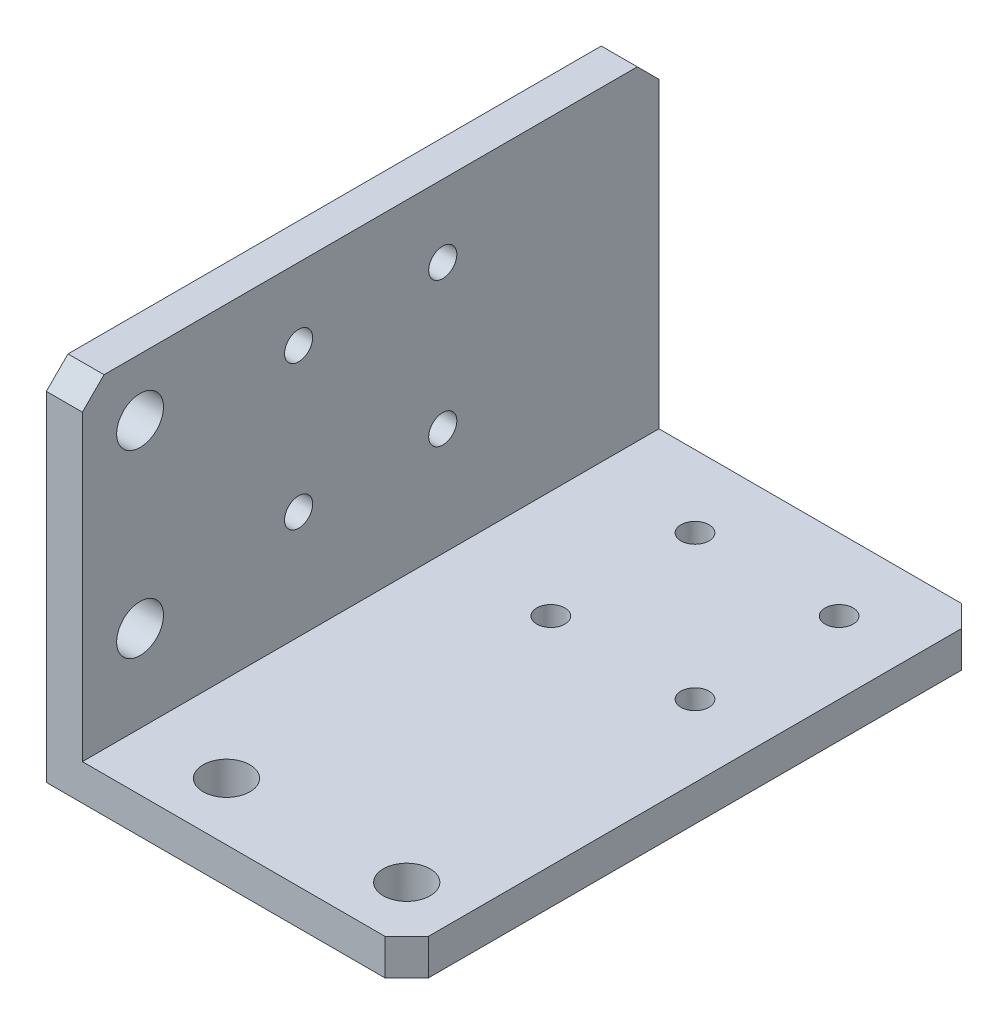
ISO-10303-21;
HEADER;
FILE_DESCRIPTION(('STEP AP214'),'2;1');
FILE_NAME('part.step','',(''),(''),'','','');
FILE_SCHEMA(('AUTOMOTIVE_DESIGN { 1 0 10303 214 1 1 1 1 }'));
ENDSEC;
DATA;
#1=APPLICATION_CONTEXT('core data for automotive mechanical design processes');
#2=APPLICATION_PROTOCOL_DEFINITION('international standard','automotive_design',2000,#1);
#3=PRODUCT_CONTEXT('',#1,'mechanical');
#4=PRODUCT('Part','Part','',(#3));
#5=PRODUCT_RELATED_PRODUCT_CATEGORY('part','',(#4));
#6=PRODUCT_DEFINITION_FORMATION('','',#4);
#7=PRODUCT_DEFINITION_CONTEXT('part definition',#1,'design');
#8=PRODUCT_DEFINITION('design','',#6,#7);
#9=PRODUCT_DEFINITION_SHAPE('','',#8);
#10=(LENGTH_UNIT() NAMED_UNIT(*) SI_UNIT(.MILLI.,.METRE.));
#11=(NAMED_UNIT(*) PLANE_ANGLE_UNIT() SI_UNIT($,.RADIAN.));
#12=(NAMED_UNIT(*) SI_UNIT($,.STERADIAN.) SOLID_ANGLE_UNIT());
#13=UNCERTAINTY_MEASURE_WITH_UNIT(LENGTH_MEASURE(1.E-05),#10,'distance_accuracy_value','');
#14=(GEOMETRIC_REPRESENTATION_CONTEXT(3) GLOBAL_UNCERTAINTY_ASSIGNED_CONTEXT((#13)) GLOBAL_UNIT_ASSIGNED_CONTEXT((#10,
#11,#12)) REPRESENTATION_CONTEXT('',''));
#15=CARTESIAN_POINT('',(0.,0.,0.));
#16=DIRECTION('',(0.,0.,1.));
#17=DIRECTION('',(1.,0.,0.));
#18=AXIS2_PLACEMENT_3D('',#15,#16,#17);
#19=CARTESIAN_POINT('',(50.,0.,80.));
#20=DIRECTION('',(0.,1.,0.));
#21=DIRECTION('',(-1.,0.,0.));
#22=AXIS2_PLACEMENT_3D('',#19,#20,#21);
#23=PLANE('',#22);
#24=CARTESIAN_POINT('',(20.,0.,30.));
#25=DIRECTION('',(0.,-1.,0.));
#26=DIRECTION('',(0.,0.,-1.));
#27=AXIS2_PLACEMENT_3D('',#24,#25,#26);
#28=CIRCLE('',#27,1.94999999999999);
#29=CARTESIAN_POINT('',(20.,0.,28.05));
#30=VERTEX_POINT('',#29);
#31=EDGE_CURVE('E410',#30,#30,#28,.T.);
#32=ORIENTED_EDGE('',*,*,#31,.F.);
#33=EDGE_LOOP('',(#32));
#34=FACE_BOUND('',#33,.T.);
#35=CARTESIAN_POINT('',(40.,0.,30.));
#36=DIRECTION('',(0.,-1.,0.));
#37=DIRECTION('',(0.,0.,-1.));
#38=AXIS2_PLACEMENT_3D('',#35,#36,#37);
#39=CIRCLE('',#38,1.94999999999999);
#40=CARTESIAN_POINT('',(40.,0.,28.0500000000001));
#41=VERTEX_POINT('',#40);
#42=EDGE_CURVE('E404',#41,#41,#39,.T.);
#43=ORIENTED_EDGE('',*,*,#42,.F.);
#44=EDGE_LOOP('',(#43));
#45=FACE_BOUND('',#44,.T.);
#46=CARTESIAN_POINT('',(40.,0.,10.));
#47=DIRECTION('',(0.,-1.,0.));
#48=DIRECTION('',(0.,0.,-1.));
#49=AXIS2_PLACEMENT_3D('',#46,#47,#48);
#50=CIRCLE('',#49,1.94999999999999);
#51=CARTESIAN_POINT('',(40.,0.,8.05000000000004));
#52=VERTEX_POINT('',#51);
#53=EDGE_CURVE('E398',#52,#52,#50,.T.);
#54=ORIENTED_EDGE('',*,*,#53,.F.);
#55=EDGE_LOOP('',(#54));
#56=FACE_BOUND('',#55,.T.);
#57=CARTESIAN_POINT('',(20.,0.,10.));
#58=DIRECTION('',(0.,-1.,0.));
#59=DIRECTION('',(0.,0.,-1.));
#60=AXIS2_PLACEMENT_3D('',#57,#58,#59);
#61=CIRCLE('',#60,1.94999999999999);
#62=CARTESIAN_POINT('',(20.,0.,8.05000000000002));
#63=VERTEX_POINT('',#62);
#64=EDGE_CURVE('E391',#63,#63,#61,.T.);
#65=ORIENTED_EDGE('',*,*,#64,.F.);
#66=EDGE_LOOP('',(#65));
#67=FACE_BOUND('',#66,.T.);
#68=CARTESIAN_POINT('',(17.,0.,72.));
#69=DIRECTION('',(0.,-1.,0.));
#70=DIRECTION('',(0.,0.,-1.));
#71=AXIS2_PLACEMENT_3D('',#68,#69,#70);
#72=CIRCLE('',#71,3.24999999999999);
#73=CARTESIAN_POINT('',(17.,0.,68.75));
#74=VERTEX_POINT('',#73);
#75=EDGE_CURVE('E172',#74,#74,#72,.T.);
#76=ORIENTED_EDGE('',*,*,#75,.F.);
#77=EDGE_LOOP('',(#76));
#78=FACE_BOUND('',#77,.T.);
#79=CARTESIAN_POINT('',(42.,0.,72.));
#80=DIRECTION('',(0.,-1.,0.));
#81=DIRECTION('',(0.,0.,-1.));
#82=AXIS2_PLACEMENT_3D('',#79,#80,#81);
#83=CIRCLE('',#82,3.24999999999999);
#84=CARTESIAN_POINT('',(42.,0.,68.75));
#85=VERTEX_POINT('',#84);
#86=EDGE_CURVE('E189',#85,#85,#83,.T.);
#87=ORIENTED_EDGE('',*,*,#86,.F.);
#88=EDGE_LOOP('',(#87));
#89=FACE_BOUND('',#88,.T.);
#90=DIRECTION('',(1.,0.,0.));
#91=VECTOR('',#90,1.);
#92=CARTESIAN_POINT('',(50.,0.,0.));
#93=LINE('',#92,#91);
#94=CARTESIAN_POINT('',(0.,0.,0.));
#95=VERTEX_POINT('',#94);
#96=CARTESIAN_POINT('',(47.,0.,0.));
#97=VERTEX_POINT('',#96);
#98=EDGE_CURVE('E154',#95,#97,#93,.T.);
#99=ORIENTED_EDGE('',*,*,#98,.T.);
#100=DIRECTION('',(0.707106781186548,0.,0.707106781186548));
#101=VECTOR('',#100,1.);
#102=CARTESIAN_POINT('',(50.,0.,3.00000000000002));
#103=LINE('',#102,#101);
#104=CARTESIAN_POINT('',(50.,0.,3.00000000000004));
#105=VERTEX_POINT('',#104);
#106=EDGE_CURVE('E217',#97,#105,#103,.T.);
#107=ORIENTED_EDGE('',*,*,#106,.T.);
#108=DIRECTION('',(0.,0.,-1.));
#109=VECTOR('',#108,1.);
#110=CARTESIAN_POINT('',(50.,0.,80.));
#111=LINE('',#110,#109);
#112=CARTESIAN_POINT('',(50.,0.,77.));
#113=VERTEX_POINT('',#112);
#114=EDGE_CURVE('E203',#113,#105,#111,.T.);
#115=ORIENTED_EDGE('',*,*,#114,.F.);
#116=DIRECTION('',(0.707106781186544,0.,-0.707106781186551));
#117=VECTOR('',#116,1.);
#118=CARTESIAN_POINT('',(47.,0.,80.));
#119=LINE('',#118,#117);
#120=CARTESIAN_POINT('',(47.,0.,80.));
#121=VERTEX_POINT('',#120);
#122=EDGE_CURVE('E57',#113,#121,#119,.F.);
#123=ORIENTED_EDGE('',*,*,#122,.T.);
#124=DIRECTION('',(1.,0.,0.));
#125=VECTOR('',#124,1.);
#126=CARTESIAN_POINT('',(50.,0.,80.));
#127=LINE('',#126,#125);
#128=CARTESIAN_POINT('',(0.,0.,80.));
#129=VERTEX_POINT('',#128);
#130=EDGE_CURVE('E129',#129,#121,#127,.T.);
#131=ORIENTED_EDGE('',*,*,#130,.F.);
#132=DIRECTION('',(0.,0.,-1.));
#133=VECTOR('',#132,1.);
#134=CARTESIAN_POINT('',(0.,0.,80.));
#135=LINE('',#134,#133);
#136=EDGE_CURVE('E150',#129,#95,#135,.T.);
#137=ORIENTED_EDGE('',*,*,#136,.T.);
#138=EDGE_LOOP('',(#99,#107,#115,#123,#131,#137));
#139=FACE_BOUND('',#138,.T.);
#140=ADVANCED_FACE('F41',(#34,#45,#56,#67,#78,#89,#139),#23,.F.);
#141=CARTESIAN_POINT('',(50.,5.,80.));
#142=DIRECTION('',(-1.,0.,0.));
#143=DIRECTION('',(0.,0.,1.));
#144=AXIS2_PLACEMENT_3D('',#141,#142,#143);
#145=PLANE('',#144);
#146=ORIENTED_EDGE('',*,*,#114,.T.);
#147=DIRECTION('',(0.,1.,0.));
#148=VECTOR('',#147,1.);
#149=CARTESIAN_POINT('',(50.,5.,3.00000000000002));
#150=LINE('',#149,#148);
#151=CARTESIAN_POINT('',(50.,5.,3.00000000000004));
#152=VERTEX_POINT('',#151);
#153=EDGE_CURVE('E340',#105,#152,#150,.T.);
#154=ORIENTED_EDGE('',*,*,#153,.T.);
#155=DIRECTION('',(0.,0.,-1.));
#156=VECTOR('',#155,1.);
#157=CARTESIAN_POINT('',(50.,5.,80.));
#158=LINE('',#157,#156);
#159=CARTESIAN_POINT('',(50.,5.,77.));
#160=VERTEX_POINT('',#159);
#161=EDGE_CURVE('E140',#160,#152,#158,.T.);
#162=ORIENTED_EDGE('',*,*,#161,.F.);
#163=DIRECTION('',(0.,-1.,0.));
#164=VECTOR('',#163,1.);
#165=CARTESIAN_POINT('',(50.,5.,77.));
#166=LINE('',#165,#164);
#167=EDGE_CURVE('E338',#160,#113,#166,.T.);
#168=ORIENTED_EDGE('',*,*,#167,.T.);
#169=EDGE_LOOP('',(#146,#154,#162,#168));
#170=FACE_BOUND('',#169,.T.);
#171=ADVANCED_FACE('F314',(#170),#145,.F.);
#172=CARTESIAN_POINT('',(5.00000000000001,5.,80.));
#173=DIRECTION('',(0.,-1.,0.));
#174=DIRECTION('',(1.,0.,0.));
#175=AXIS2_PLACEMENT_3D('',#172,#173,#174);
#176=PLANE('',#175);
#177=CARTESIAN_POINT('',(20.,5.,30.));
#178=DIRECTION('',(0.,-1.,0.));
#179=DIRECTION('',(1.,0.,0.));
#180=AXIS2_PLACEMENT_3D('',#177,#178,#179);
#181=CIRCLE('',#180,1.94999999999999);
#182=CARTESIAN_POINT('',(21.95,5.,30.));
#183=VERTEX_POINT('',#182);
#184=EDGE_CURVE('E407',#183,#183,#181,.T.);
#185=ORIENTED_EDGE('',*,*,#184,.T.);
#186=EDGE_LOOP('',(#185));
#187=FACE_BOUND('',#186,.T.);
#188=CARTESIAN_POINT('',(40.,5.,30.));
#189=DIRECTION('',(0.,-1.,0.));
#190=DIRECTION('',(1.,0.,0.));
#191=AXIS2_PLACEMENT_3D('',#188,#189,#190);
#192=CIRCLE('',#191,1.94999999999999);
#193=CARTESIAN_POINT('',(41.95,5.,30.));
#194=VERTEX_POINT('',#193);
#195=EDGE_CURVE('E401',#194,#194,#192,.T.);
#196=ORIENTED_EDGE('',*,*,#195,.T.);
#197=EDGE_LOOP('',(#196));
#198=FACE_BOUND('',#197,.T.);
#199=CARTESIAN_POINT('',(40.,5.,10.));
#200=DIRECTION('',(0.,-1.,0.));
#201=DIRECTION('',(1.,0.,0.));
#202=AXIS2_PLACEMENT_3D('',#199,#200,#201);
#203=CIRCLE('',#202,1.94999999999999);
#204=CARTESIAN_POINT('',(41.95,5.,10.));
#205=VERTEX_POINT('',#204);
#206=EDGE_CURVE('E395',#205,#205,#203,.T.);
#207=ORIENTED_EDGE('',*,*,#206,.T.);
#208=EDGE_LOOP('',(#207));
#209=FACE_BOUND('',#208,.T.);
#210=CARTESIAN_POINT('',(20.,5.,10.));
#211=DIRECTION('',(0.,-1.,0.));
#212=DIRECTION('',(1.,0.,0.));
#213=AXIS2_PLACEMENT_3D('',#210,#211,#212);
#214=CIRCLE('',#213,1.94999999999999);
#215=CARTESIAN_POINT('',(21.95,5.,10.));
#216=VERTEX_POINT('',#215);
#217=EDGE_CURVE('E45',#216,#216,#214,.T.);
#218=ORIENTED_EDGE('',*,*,#217,.T.);
#219=EDGE_LOOP('',(#218));
#220=FACE_BOUND('',#219,.T.);
#221=CARTESIAN_POINT('',(17.,5.,72.));
#222=DIRECTION('',(0.,-1.,0.));
#223=DIRECTION('',(1.,0.,0.));
#224=AXIS2_PLACEMENT_3D('',#221,#222,#223);
#225=CIRCLE('',#224,3.24999999999999);
#226=CARTESIAN_POINT('',(20.25,5.,72.));
#227=VERTEX_POINT('',#226);
#228=EDGE_CURVE('E178',#227,#227,#225,.T.);
#229=ORIENTED_EDGE('',*,*,#228,.T.);
#230=EDGE_LOOP('',(#229));
#231=FACE_BOUND('',#230,.T.);
#232=CARTESIAN_POINT('',(42.,5.,72.));
#233=DIRECTION('',(0.,-1.,0.));
#234=DIRECTION('',(1.,0.,0.));
#235=AXIS2_PLACEMENT_3D('',#232,#233,#234);
#236=CIRCLE('',#235,3.24999999999999);
#237=CARTESIAN_POINT('',(45.25,5.,72.));
#238=VERTEX_POINT('',#237);
#239=EDGE_CURVE('E193',#238,#238,#236,.T.);
#240=ORIENTED_EDGE('',*,*,#239,.T.);
#241=EDGE_LOOP('',(#240));
#242=FACE_BOUND('',#241,.T.);
#243=ORIENTED_EDGE('',*,*,#161,.T.);
#244=DIRECTION('',(-0.707106781186548,0.,-0.707106781186548));
#245=VECTOR('',#244,1.);
#246=CARTESIAN_POINT('',(50.,5.,3.00000000000002));
#247=LINE('',#246,#245);
#248=CARTESIAN_POINT('',(47.,5.,0.));
#249=VERTEX_POINT('',#248);
#250=EDGE_CURVE('E339',#152,#249,#247,.T.);
#251=ORIENTED_EDGE('',*,*,#250,.T.);
#252=DIRECTION('',(-1.,0.,0.));
#253=VECTOR('',#252,1.);
#254=CARTESIAN_POINT('',(5.00000000000001,5.,0.));
#255=LINE('',#254,#253);
#256=CARTESIAN_POINT('',(5.00000000000001,5.,0.));
#257=VERTEX_POINT('',#256);
#258=EDGE_CURVE('E136',#249,#257,#255,.T.);
#259=ORIENTED_EDGE('',*,*,#258,.T.);
#260=DIRECTION('',(0.,0.,-1.));
#261=VECTOR('',#260,1.);
#262=CARTESIAN_POINT('',(5.00000000000001,5.,80.));
#263=LINE('',#262,#261);
#264=CARTESIAN_POINT('',(5.00000000000001,5.,80.));
#265=VERTEX_POINT('',#264);
#266=EDGE_CURVE('E132',#265,#257,#263,.T.);
#267=ORIENTED_EDGE('',*,*,#266,.F.);
#268=DIRECTION('',(-1.,0.,0.));
#269=VECTOR('',#268,1.);
#270=CARTESIAN_POINT('',(5.00000000000001,5.,80.));
#271=LINE('',#270,#269);
#272=CARTESIAN_POINT('',(47.,5.,80.));
#273=VERTEX_POINT('',#272);
#274=EDGE_CURVE('E121',#273,#265,#271,.T.);
#275=ORIENTED_EDGE('',*,*,#274,.F.);
#276=DIRECTION('',(-0.707106781186544,0.,0.707106781186551));
#277=VECTOR('',#276,1.);
#278=CARTESIAN_POINT('',(47.,5.,80.));
#279=LINE('',#278,#277);
#280=EDGE_CURVE('E65',#273,#160,#279,.F.);
#281=ORIENTED_EDGE('',*,*,#280,.T.);
#282=EDGE_LOOP('',(#243,#251,#259,#267,#275,#281));
#283=FACE_BOUND('',#282,.T.);
#284=ADVANCED_FACE('F134',(#187,#198,#209,#220,#231,#242,#283),#176,.F.);
#285=CARTESIAN_POINT('',(5.,50.,80.));
#286=DIRECTION('',(-1.,0.,0.));
#287=DIRECTION('',(0.,-1.,0.));
#288=AXIS2_PLACEMENT_3D('',#285,#286,#287);
#289=PLANE('',#288);
#290=CARTESIAN_POINT('',(5.,40.,30.));
#291=DIRECTION('',(-1.,0.,0.));
#292=DIRECTION('',(0.,-1.,0.));
#293=AXIS2_PLACEMENT_3D('',#290,#291,#292);
#294=CIRCLE('',#293,1.94999999999999);
#295=CARTESIAN_POINT('',(5.,38.05,30.));
#296=VERTEX_POINT('',#295);
#297=EDGE_CURVE('E431',#296,#296,#294,.T.);
#298=ORIENTED_EDGE('',*,*,#297,.T.);
#299=EDGE_LOOP('',(#298));
#300=FACE_BOUND('',#299,.T.);
#301=CARTESIAN_POINT('',(5.,40.,50.));
#302=DIRECTION('',(-1.,0.,0.));
#303=DIRECTION('',(0.,-1.,0.));
#304=AXIS2_PLACEMENT_3D('',#301,#302,#303);
#305=CIRCLE('',#304,1.94999999999999);
#306=CARTESIAN_POINT('',(5.,38.05,50.));
#307=VERTEX_POINT('',#306);
#308=EDGE_CURVE('E425',#307,#307,#305,.T.);
#309=ORIENTED_EDGE('',*,*,#308,.T.);
#310=EDGE_LOOP('',(#309));
#311=FACE_BOUND('',#310,.T.);
#312=CARTESIAN_POINT('',(5.00000000000001,20.,50.));
#313=DIRECTION('',(-1.,0.,0.));
#314=DIRECTION('',(0.,-1.,0.));
#315=AXIS2_PLACEMENT_3D('',#312,#313,#314);
#316=CIRCLE('',#315,1.94999999999999);
#317=CARTESIAN_POINT('',(5.00000000000001,18.05,50.));
#318=VERTEX_POINT('',#317);
#319=EDGE_CURVE('E419',#318,#318,#316,.T.);
#320=ORIENTED_EDGE('',*,*,#319,.T.);
#321=EDGE_LOOP('',(#320));
#322=FACE_BOUND('',#321,.T.);
#323=CARTESIAN_POINT('',(5.00000000000001,20.,30.));
#324=DIRECTION('',(-1.,0.,0.));
#325=DIRECTION('',(0.,-1.,0.));
#326=AXIS2_PLACEMENT_3D('',#323,#324,#325);
#327=CIRCLE('',#326,1.94999999999999);
#328=CARTESIAN_POINT('',(5.00000000000001,18.05,30.));
#329=VERTEX_POINT('',#328);
#330=EDGE_CURVE('E413',#329,#329,#327,.T.);
#331=ORIENTED_EDGE('',*,*,#330,.T.);
#332=EDGE_LOOP('',(#331));
#333=FACE_BOUND('',#332,.T.);
#334=CARTESIAN_POINT('',(5.,42.,72.));
#335=DIRECTION('',(-1.,0.,0.));
#336=DIRECTION('',(0.,0.,1.));
#337=AXIS2_PLACEMENT_3D('',#334,#335,#336);
#338=CIRCLE('',#337,3.25);
#339=CARTESIAN_POINT('',(5.,42.,75.25));
#340=VERTEX_POINT('',#339);
#341=EDGE_CURVE('E380',#340,#340,#338,.T.);
#342=ORIENTED_EDGE('',*,*,#341,.T.);
#343=EDGE_LOOP('',(#342));
#344=FACE_BOUND('',#343,.T.);
#345=CARTESIAN_POINT('',(5.,17.,72.));
#346=DIRECTION('',(-1.,0.,0.));
#347=DIRECTION('',(0.,0.,1.));
#348=AXIS2_PLACEMENT_3D('',#345,#346,#347);
#349=CIRCLE('',#348,3.25);
#350=CARTESIAN_POINT('',(5.,17.,75.25));
#351=VERTEX_POINT('',#350);
#352=EDGE_CURVE('E179',#351,#351,#349,.T.);
#353=ORIENTED_EDGE('',*,*,#352,.T.);
#354=EDGE_LOOP('',(#353));
#355=FACE_BOUND('',#354,.T.);
#356=DIRECTION('',(0.,1.,0.));
#357=VECTOR('',#356,1.);
#358=CARTESIAN_POINT('',(5.,50.,0.));
#359=LINE('',#358,#357);
#360=CARTESIAN_POINT('',(5.,47.,0.));
#361=VERTEX_POINT('',#360);
#362=EDGE_CURVE('E243',#257,#361,#359,.T.);
#363=ORIENTED_EDGE('',*,*,#362,.T.);
#364=DIRECTION('',(0.,0.707106781186548,0.707106781186548));
#365=VECTOR('',#364,1.);
#366=CARTESIAN_POINT('',(5.,50.,3.00000000000002));
#367=LINE('',#366,#365);
#368=CARTESIAN_POINT('',(5.,50.,3.00000000000004));
#369=VERTEX_POINT('',#368);
#370=EDGE_CURVE('E287',#361,#369,#367,.T.);
#371=ORIENTED_EDGE('',*,*,#370,.T.);
#372=DIRECTION('',(0.,0.,-1.));
#373=VECTOR('',#372,1.);
#374=CARTESIAN_POINT('',(5.,50.,80.));
#375=LINE('',#374,#373);
#376=CARTESIAN_POINT('',(5.,50.,77.));
#377=VERTEX_POINT('',#376);
#378=EDGE_CURVE('E141',#377,#369,#375,.T.);
#379=ORIENTED_EDGE('',*,*,#378,.F.);
#380=DIRECTION('',(0.,0.707106781186544,-0.707106781186551));
#381=VECTOR('',#380,1.);
#382=CARTESIAN_POINT('',(5.,47.,80.));
#383=LINE('',#382,#381);
#384=CARTESIAN_POINT('',(5.,47.,80.));
#385=VERTEX_POINT('',#384);
#386=EDGE_CURVE('E146',#377,#385,#383,.F.);
#387=ORIENTED_EDGE('',*,*,#386,.T.);
#388=DIRECTION('',(0.,1.,0.));
#389=VECTOR('',#388,1.);
#390=CARTESIAN_POINT('',(5.,50.,80.));
#391=LINE('',#390,#389);
#392=EDGE_CURVE('E126',#265,#385,#391,.T.);
#393=ORIENTED_EDGE('',*,*,#392,.F.);
#394=ORIENTED_EDGE('',*,*,#266,.T.);
#395=EDGE_LOOP('',(#363,#371,#379,#387,#393,#394));
#396=FACE_BOUND('',#395,.T.);
#397=ADVANCED_FACE('F143',(#300,#311,#322,#333,#344,#355,#396),#289,.F.);
#398=CARTESIAN_POINT('',(0.,50.,80.));
#399=DIRECTION('',(0.,-1.,0.));
#400=DIRECTION('',(0.,0.,-1.));
#401=AXIS2_PLACEMENT_3D('',#398,#399,#400);
#402=PLANE('',#401);
#403=ORIENTED_EDGE('',*,*,#378,.T.);
#404=DIRECTION('',(-1.,0.,0.));
#405=VECTOR('',#404,1.);
#406=CARTESIAN_POINT('',(0.,50.,3.00000000000002));
#407=LINE('',#406,#405);
#408=CARTESIAN_POINT('',(0.,50.,3.00000000000004));
#409=VERTEX_POINT('',#408);
#410=EDGE_CURVE('E281',#369,#409,#407,.T.);
#411=ORIENTED_EDGE('',*,*,#410,.T.);
#412=DIRECTION('',(0.,0.,-1.));
#413=VECTOR('',#412,1.);
#414=CARTESIAN_POINT('',(0.,50.,80.));
#415=LINE('',#414,#413);
#416=CARTESIAN_POINT('',(0.,50.,77.));
#417=VERTEX_POINT('',#416);
#418=EDGE_CURVE('E238',#417,#409,#415,.T.);
#419=ORIENTED_EDGE('',*,*,#418,.F.);
#420=DIRECTION('',(1.,0.,0.));
#421=VECTOR('',#420,1.);
#422=CARTESIAN_POINT('',(0.,50.,77.));
#423=LINE('',#422,#421);
#424=EDGE_CURVE('E209',#417,#377,#423,.T.);
#425=ORIENTED_EDGE('',*,*,#424,.T.);
#426=EDGE_LOOP('',(#403,#411,#419,#425));
#427=FACE_BOUND('',#426,.T.);
#428=ADVANCED_FACE('F280',(#427),#402,.F.);
#429=CARTESIAN_POINT('',(0.,0.,80.));
#430=DIRECTION('',(1.,0.,0.));
#431=DIRECTION('',(0.,0.,-1.));
#432=AXIS2_PLACEMENT_3D('',#429,#430,#431);
#433=PLANE('',#432);
#434=CARTESIAN_POINT('',(0.,40.,30.));
#435=DIRECTION('',(-1.,0.,0.));
#436=DIRECTION('',(0.,0.,1.));
#437=AXIS2_PLACEMENT_3D('',#434,#435,#436);
#438=CIRCLE('',#437,1.94999999999999);
#439=CARTESIAN_POINT('',(0.,40.,31.95));
#440=VERTEX_POINT('',#439);
#441=EDGE_CURVE('E434',#440,#440,#438,.T.);
#442=ORIENTED_EDGE('',*,*,#441,.F.);
#443=EDGE_LOOP('',(#442));
#444=FACE_BOUND('',#443,.T.);
#445=CARTESIAN_POINT('',(0.,40.,50.));
#446=DIRECTION('',(-1.,0.,0.));
#447=DIRECTION('',(0.,0.,1.));
#448=AXIS2_PLACEMENT_3D('',#445,#446,#447);
#449=CIRCLE('',#448,1.94999999999999);
#450=CARTESIAN_POINT('',(0.,40.,51.95));
#451=VERTEX_POINT('',#450);
#452=EDGE_CURVE('E428',#451,#451,#449,.T.);
#453=ORIENTED_EDGE('',*,*,#452,.F.);
#454=EDGE_LOOP('',(#453));
#455=FACE_BOUND('',#454,.T.);
#456=CARTESIAN_POINT('',(0.,20.,50.));
#457=DIRECTION('',(-1.,0.,0.));
#458=DIRECTION('',(0.,0.,1.));
#459=AXIS2_PLACEMENT_3D('',#456,#457,#458);
#460=CIRCLE('',#459,1.94999999999999);
#461=CARTESIAN_POINT('',(0.,20.,51.95));
#462=VERTEX_POINT('',#461);
#463=EDGE_CURVE('E422',#462,#462,#460,.T.);
#464=ORIENTED_EDGE('',*,*,#463,.F.);
#465=EDGE_LOOP('',(#464));
#466=FACE_BOUND('',#465,.T.);
#467=CARTESIAN_POINT('',(0.,20.,30.));
#468=DIRECTION('',(-1.,0.,0.));
#469=DIRECTION('',(0.,0.,1.));
#470=AXIS2_PLACEMENT_3D('',#467,#468,#469);
#471=CIRCLE('',#470,1.94999999999999);
#472=CARTESIAN_POINT('',(0.,20.,31.95));
#473=VERTEX_POINT('',#472);
#474=EDGE_CURVE('E416',#473,#473,#471,.T.);
#475=ORIENTED_EDGE('',*,*,#474,.F.);
#476=EDGE_LOOP('',(#475));
#477=FACE_BOUND('',#476,.T.);
#478=CARTESIAN_POINT('',(0.,42.,72.));
#479=DIRECTION('',(-1.,0.,0.));
#480=DIRECTION('',(0.,0.,1.));
#481=AXIS2_PLACEMENT_3D('',#478,#479,#480);
#482=CIRCLE('',#481,3.24999999999999);
#483=CARTESIAN_POINT('',(0.,42.,75.25));
#484=VERTEX_POINT('',#483);
#485=EDGE_CURVE('E382',#484,#484,#482,.T.);
#486=ORIENTED_EDGE('',*,*,#485,.F.);
#487=EDGE_LOOP('',(#486));
#488=FACE_BOUND('',#487,.T.);
#489=CARTESIAN_POINT('',(0.,17.,72.));
#490=DIRECTION('',(-1.,0.,0.));
#491=DIRECTION('',(0.,0.,1.));
#492=AXIS2_PLACEMENT_3D('',#489,#490,#491);
#493=CIRCLE('',#492,3.24999999999999);
#494=CARTESIAN_POINT('',(0.,17.,75.25));
#495=VERTEX_POINT('',#494);
#496=EDGE_CURVE('E377',#495,#495,#493,.T.);
#497=ORIENTED_EDGE('',*,*,#496,.F.);
#498=EDGE_LOOP('',(#497));
#499=FACE_BOUND('',#498,.T.);
#500=ORIENTED_EDGE('',*,*,#418,.T.);
#501=DIRECTION('',(0.,-0.707106781186548,-0.707106781186548));
#502=VECTOR('',#501,1.);
#503=CARTESIAN_POINT('',(0.,50.,3.00000000000002));
#504=LINE('',#503,#502);
#505=CARTESIAN_POINT('',(0.,47.,0.));
#506=VERTEX_POINT('',#505);
#507=EDGE_CURVE('E260',#409,#506,#504,.T.);
#508=ORIENTED_EDGE('',*,*,#507,.T.);
#509=DIRECTION('',(0.,-1.,0.));
#510=VECTOR('',#509,1.);
#511=CARTESIAN_POINT('',(0.,0.,0.));
#512=LINE('',#511,#510);
#513=EDGE_CURVE('E235',#506,#95,#512,.T.);
#514=ORIENTED_EDGE('',*,*,#513,.T.);
#515=ORIENTED_EDGE('',*,*,#136,.F.);
#516=DIRECTION('',(0.,-1.,0.));
#517=VECTOR('',#516,1.);
#518=CARTESIAN_POINT('',(0.,0.,80.));
#519=LINE('',#518,#517);
#520=CARTESIAN_POINT('',(0.,47.,80.));
#521=VERTEX_POINT('',#520);
#522=EDGE_CURVE('E147',#521,#129,#519,.T.);
#523=ORIENTED_EDGE('',*,*,#522,.F.);
#524=DIRECTION('',(0.,-0.707106781186544,0.707106781186551));
#525=VECTOR('',#524,1.);
#526=CARTESIAN_POINT('',(0.,47.,80.));
#527=LINE('',#526,#525);
#528=EDGE_CURVE('E231',#521,#417,#527,.F.);
#529=ORIENTED_EDGE('',*,*,#528,.T.);
#530=EDGE_LOOP('',(#500,#508,#514,#515,#523,#529));
#531=FACE_BOUND('',#530,.T.);
#532=ADVANCED_FACE('F230',(#444,#455,#466,#477,#488,#499,#531),#433,.F.);
#533=CARTESIAN_POINT('',(0.,0.,80.));
#534=DIRECTION('',(0.,0.,-1.));
#535=DIRECTION('',(-1.,0.,0.));
#536=AXIS2_PLACEMENT_3D('',#533,#534,#535);
#537=PLANE('',#536);
#538=ORIENTED_EDGE('',*,*,#130,.T.);
#539=DIRECTION('',(0.,1.,0.));
#540=VECTOR('',#539,1.);
#541=CARTESIAN_POINT('',(47.,0.,80.));
#542=LINE('',#541,#540);
#543=EDGE_CURVE('E12',#121,#273,#542,.T.);
#544=ORIENTED_EDGE('',*,*,#543,.T.);
#545=ORIENTED_EDGE('',*,*,#274,.T.);
#546=ORIENTED_EDGE('',*,*,#392,.T.);
#547=DIRECTION('',(-1.,0.,0.));
#548=VECTOR('',#547,1.);
#549=CARTESIAN_POINT('',(0.,47.,80.));
#550=LINE('',#549,#548);
#551=EDGE_CURVE('E50',#385,#521,#550,.T.);
#552=ORIENTED_EDGE('',*,*,#551,.T.);
#553=ORIENTED_EDGE('',*,*,#522,.T.);
#554=EDGE_LOOP('',(#538,#544,#545,#546,#552,#553));
#555=FACE_BOUND('',#554,.T.);
#556=ADVANCED_FACE('F123',(#555),#537,.F.);
#557=CARTESIAN_POINT('',(0.,0.,0.));
#558=DIRECTION('',(0.,0.,-1.));
#559=DIRECTION('',(-1.,0.,0.));
#560=AXIS2_PLACEMENT_3D('',#557,#558,#559);
#561=PLANE('',#560);
#562=ORIENTED_EDGE('',*,*,#513,.F.);
#563=DIRECTION('',(1.,0.,0.));
#564=VECTOR('',#563,1.);
#565=CARTESIAN_POINT('',(5.,47.,0.));
#566=LINE('',#565,#564);
#567=EDGE_CURVE('E289',#506,#361,#566,.T.);
#568=ORIENTED_EDGE('',*,*,#567,.T.);
#569=ORIENTED_EDGE('',*,*,#362,.F.);
#570=ORIENTED_EDGE('',*,*,#258,.F.);
#571=DIRECTION('',(0.,-1.,0.));
#572=VECTOR('',#571,1.);
#573=CARTESIAN_POINT('',(47.,0.,0.));
#574=LINE('',#573,#572);
#575=EDGE_CURVE('E264',#249,#97,#574,.T.);
#576=ORIENTED_EDGE('',*,*,#575,.T.);
#577=ORIENTED_EDGE('',*,*,#98,.F.);
#578=EDGE_LOOP('',(#562,#568,#569,#570,#576,#577));
#579=FACE_BOUND('',#578,.T.);
#580=ADVANCED_FACE('F291',(#579),#561,.T.);
#581=CARTESIAN_POINT('',(42.,0.,72.));
#582=DIRECTION('',(0.,-1.,0.));
#583=DIRECTION('',(0.,0.,-1.));
#584=AXIS2_PLACEMENT_3D('',#581,#582,#583);
#585=CYLINDRICAL_SURFACE('',#584,3.24999999999999);
#586=ORIENTED_EDGE('',*,*,#86,.T.);
#587=EDGE_LOOP('',(#586));
#588=FACE_BOUND('',#587,.T.);
#589=ORIENTED_EDGE('',*,*,#239,.F.);
#590=EDGE_LOOP('',(#589));
#591=FACE_BOUND('',#590,.T.);
#592=ADVANCED_FACE('F299',(#588,#591),#585,.F.);
#593=CARTESIAN_POINT('',(17.,0.,72.));
#594=DIRECTION('',(0.,-1.,0.));
#595=DIRECTION('',(0.,0.,-1.));
#596=AXIS2_PLACEMENT_3D('',#593,#594,#595);
#597=CYLINDRICAL_SURFACE('',#596,3.24999999999999);
#598=ORIENTED_EDGE('',*,*,#75,.T.);
#599=EDGE_LOOP('',(#598));
#600=FACE_BOUND('',#599,.T.);
#601=ORIENTED_EDGE('',*,*,#228,.F.);
#602=EDGE_LOOP('',(#601));
#603=FACE_BOUND('',#602,.T.);
#604=ADVANCED_FACE('F301',(#600,#603),#597,.F.);
#605=CARTESIAN_POINT('',(0.,17.,72.));
#606=DIRECTION('',(-1.,0.,0.));
#607=DIRECTION('',(0.,0.,1.));
#608=AXIS2_PLACEMENT_3D('',#605,#606,#607);
#609=CYLINDRICAL_SURFACE('',#608,3.24999999999999);
#610=ORIENTED_EDGE('',*,*,#352,.F.);
#611=EDGE_LOOP('',(#610));
#612=FACE_BOUND('',#611,.T.);
#613=ORIENTED_EDGE('',*,*,#496,.T.);
#614=EDGE_LOOP('',(#613));
#615=FACE_BOUND('',#614,.T.);
#616=ADVANCED_FACE('F308',(#612,#615),#609,.F.);
#617=CARTESIAN_POINT('',(0.,42.,72.));
#618=DIRECTION('',(-1.,0.,0.));
#619=DIRECTION('',(0.,0.,1.));
#620=AXIS2_PLACEMENT_3D('',#617,#618,#619);
#621=CYLINDRICAL_SURFACE('',#620,3.24999999999999);
#622=ORIENTED_EDGE('',*,*,#341,.F.);
#623=EDGE_LOOP('',(#622));
#624=FACE_BOUND('',#623,.T.);
#625=ORIENTED_EDGE('',*,*,#485,.T.);
#626=EDGE_LOOP('',(#625));
#627=FACE_BOUND('',#626,.T.);
#628=ADVANCED_FACE('F329',(#624,#627),#621,.F.);
#629=CARTESIAN_POINT('',(0.,50.,3.00000000000002));
#630=DIRECTION('',(0.,0.707106781186548,-0.707106781186548));
#631=DIRECTION('',(1.,0.,0.));
#632=AXIS2_PLACEMENT_3D('',#629,#630,#631);
#633=PLANE('',#632);
#634=ORIENTED_EDGE('',*,*,#370,.F.);
#635=ORIENTED_EDGE('',*,*,#567,.F.);
#636=ORIENTED_EDGE('',*,*,#507,.F.);
#637=ORIENTED_EDGE('',*,*,#410,.F.);
#638=EDGE_LOOP('',(#634,#635,#636,#637));
#639=FACE_BOUND('',#638,.T.);
#640=ADVANCED_FACE('F285',(#639),#633,.T.);
#641=CARTESIAN_POINT('',(50.,5.,3.00000000000002));
#642=DIRECTION('',(0.707106781186548,0.,-0.707106781186548));
#643=DIRECTION('',(0.,-1.,0.));
#644=AXIS2_PLACEMENT_3D('',#641,#642,#643);
#645=PLANE('',#644);
#646=ORIENTED_EDGE('',*,*,#106,.F.);
#647=ORIENTED_EDGE('',*,*,#575,.F.);
#648=ORIENTED_EDGE('',*,*,#250,.F.);
#649=ORIENTED_EDGE('',*,*,#153,.F.);
#650=EDGE_LOOP('',(#646,#647,#648,#649));
#651=FACE_BOUND('',#650,.T.);
#652=ADVANCED_FACE('F328',(#651),#645,.T.);
#653=CARTESIAN_POINT('',(47.,0.,80.));
#654=DIRECTION('',(-0.707106781186551,0.,-0.707106781186544));
#655=DIRECTION('',(0.,1.,0.));
#656=AXIS2_PLACEMENT_3D('',#653,#654,#655);
#657=PLANE('',#656);
#658=ORIENTED_EDGE('',*,*,#122,.F.);
#659=ORIENTED_EDGE('',*,*,#167,.F.);
#660=ORIENTED_EDGE('',*,*,#280,.F.);
#661=ORIENTED_EDGE('',*,*,#543,.F.);
#662=EDGE_LOOP('',(#658,#659,#660,#661));
#663=FACE_BOUND('',#662,.T.);
#664=ADVANCED_FACE('F331',(#663),#657,.F.);
#665=CARTESIAN_POINT('',(0.,47.,80.));
#666=DIRECTION('',(0.,-0.707106781186551,-0.707106781186544));
#667=DIRECTION('',(-1.,0.,0.));
#668=AXIS2_PLACEMENT_3D('',#665,#666,#667);
#669=PLANE('',#668);
#670=ORIENTED_EDGE('',*,*,#386,.F.);
#671=ORIENTED_EDGE('',*,*,#424,.F.);
#672=ORIENTED_EDGE('',*,*,#528,.F.);
#673=ORIENTED_EDGE('',*,*,#551,.F.);
#674=EDGE_LOOP('',(#670,#671,#672,#673));
#675=FACE_BOUND('',#674,.T.);
#676=ADVANCED_FACE('F43',(#675),#669,.F.);
#677=CARTESIAN_POINT('',(20.,0.,10.));
#678=DIRECTION('',(0.,-1.,0.));
#679=DIRECTION('',(0.,0.,-1.));
#680=AXIS2_PLACEMENT_3D('',#677,#678,#679);
#681=CYLINDRICAL_SURFACE('',#680,1.94999999999999);
#682=ORIENTED_EDGE('',*,*,#64,.T.);
#683=EDGE_LOOP('',(#682));
#684=FACE_BOUND('',#683,.T.);
#685=ORIENTED_EDGE('',*,*,#217,.F.);
#686=EDGE_LOOP('',(#685));
#687=FACE_BOUND('',#686,.T.);
#688=ADVANCED_FACE('F337',(#684,#687),#681,.F.);
#689=CARTESIAN_POINT('',(40.,0.,10.));
#690=DIRECTION('',(0.,-1.,0.));
#691=DIRECTION('',(0.,0.,-1.));
#692=AXIS2_PLACEMENT_3D('',#689,#690,#691);
#693=CYLINDRICAL_SURFACE('',#692,1.94999999999999);
#694=ORIENTED_EDGE('',*,*,#53,.T.);
#695=EDGE_LOOP('',(#694));
#696=FACE_BOUND('',#695,.T.);
#697=ORIENTED_EDGE('',*,*,#206,.F.);
#698=EDGE_LOOP('',(#697));
#699=FACE_BOUND('',#698,.T.);
#700=ADVANCED_FACE('F352',(#696,#699),#693,.F.);
#701=CARTESIAN_POINT('',(40.,0.,30.));
#702=DIRECTION('',(0.,-1.,0.));
#703=DIRECTION('',(0.,0.,-1.));
#704=AXIS2_PLACEMENT_3D('',#701,#702,#703);
#705=CYLINDRICAL_SURFACE('',#704,1.94999999999999);
#706=ORIENTED_EDGE('',*,*,#42,.T.);
#707=EDGE_LOOP('',(#706));
#708=FACE_BOUND('',#707,.T.);
#709=ORIENTED_EDGE('',*,*,#195,.F.);
#710=EDGE_LOOP('',(#709));
#711=FACE_BOUND('',#710,.T.);
#712=ADVANCED_FACE('F358',(#708,#711),#705,.F.);
#713=CARTESIAN_POINT('',(20.,0.,30.));
#714=DIRECTION('',(0.,-1.,0.));
#715=DIRECTION('',(0.,0.,-1.));
#716=AXIS2_PLACEMENT_3D('',#713,#714,#715);
#717=CYLINDRICAL_SURFACE('',#716,1.94999999999999);
#718=ORIENTED_EDGE('',*,*,#31,.T.);
#719=EDGE_LOOP('',(#718));
#720=FACE_BOUND('',#719,.T.);
#721=ORIENTED_EDGE('',*,*,#184,.F.);
#722=EDGE_LOOP('',(#721));
#723=FACE_BOUND('',#722,.T.);
#724=ADVANCED_FACE('F457',(#720,#723),#717,.F.);
#725=CARTESIAN_POINT('',(0.,20.,30.));
#726=DIRECTION('',(-1.,0.,0.));
#727=DIRECTION('',(0.,0.,1.));
#728=AXIS2_PLACEMENT_3D('',#725,#726,#727);
#729=CYLINDRICAL_SURFACE('',#728,1.94999999999999);
#730=ORIENTED_EDGE('',*,*,#474,.T.);
#731=EDGE_LOOP('',(#730));
#732=FACE_BOUND('',#731,.T.);
#733=ORIENTED_EDGE('',*,*,#330,.F.);
#734=EDGE_LOOP('',(#733));
#735=FACE_BOUND('',#734,.T.);
#736=ADVANCED_FACE('F453',(#732,#735),#729,.F.);
#737=CARTESIAN_POINT('',(0.,20.,50.));
#738=DIRECTION('',(-1.,0.,0.));
#739=DIRECTION('',(0.,0.,1.));
#740=AXIS2_PLACEMENT_3D('',#737,#738,#739);
#741=CYLINDRICAL_SURFACE('',#740,1.94999999999999);
#742=ORIENTED_EDGE('',*,*,#463,.T.);
#743=EDGE_LOOP('',(#742));
#744=FACE_BOUND('',#743,.T.);
#745=ORIENTED_EDGE('',*,*,#319,.F.);
#746=EDGE_LOOP('',(#745));
#747=FACE_BOUND('',#746,.T.);
#748=ADVANCED_FACE('F456',(#744,#747),#741,.F.);
#749=CARTESIAN_POINT('',(0.,40.,50.));
#750=DIRECTION('',(-1.,0.,0.));
#751=DIRECTION('',(0.,0.,1.));
#752=AXIS2_PLACEMENT_3D('',#749,#750,#751);
#753=CYLINDRICAL_SURFACE('',#752,1.94999999999999);
#754=ORIENTED_EDGE('',*,*,#452,.T.);
#755=EDGE_LOOP('',(#754));
#756=FACE_BOUND('',#755,.T.);
#757=ORIENTED_EDGE('',*,*,#308,.F.);
#758=EDGE_LOOP('',(#757));
#759=FACE_BOUND('',#758,.T.);
#760=ADVANCED_FACE('F577',(#756,#759),#753,.F.);
#761=CARTESIAN_POINT('',(0.,40.,30.));
#762=DIRECTION('',(-1.,0.,0.));
#763=DIRECTION('',(0.,0.,1.));
#764=AXIS2_PLACEMENT_3D('',#761,#762,#763);
#765=CYLINDRICAL_SURFACE('',#764,1.94999999999999);
#766=ORIENTED_EDGE('',*,*,#441,.T.);
#767=EDGE_LOOP('',(#766));
#768=FACE_BOUND('',#767,.T.);
#769=ORIENTED_EDGE('',*,*,#297,.F.);
#770=EDGE_LOOP('',(#769));
#771=FACE_BOUND('',#770,.T.);
#772=ADVANCED_FACE('F438',(#768,#771),#765,.F.);
#773=CLOSED_SHELL('',(#140,#171,#284,#397,#428,#532,#556,#580,#592,#604,#616,#628,#640,#652,
#664,#676,#688,#700,#712,#724,#736,#748,#760,#772));
#774=MANIFOLD_SOLID_BREP('B2',#773);
#775=ADVANCED_BREP_SHAPE_REPRESENTATION('',(#18,#774),#14);
#776=SHAPE_DEFINITION_REPRESENTATION(#9,#775);
ENDSEC;
END-ISO-10303-21;
